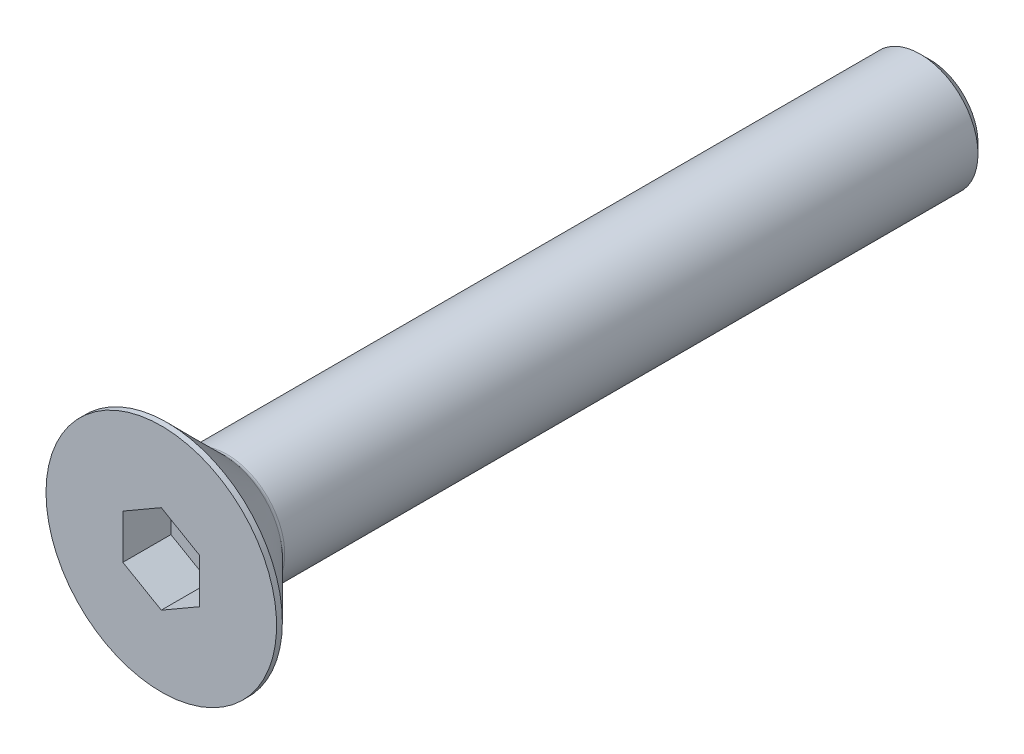
ISO-10303-21;
HEADER;
FILE_DESCRIPTION(('STEP AP214'),'2;1');
FILE_NAME('part.step','',(''),(''),'','','');
FILE_SCHEMA(('AUTOMOTIVE_DESIGN { 1 0 10303 214 1 1 1 1 }'));
ENDSEC;
DATA;
#1=APPLICATION_CONTEXT('core data for automotive mechanical design processes');
#2=APPLICATION_PROTOCOL_DEFINITION('international standard','automotive_design',2000,#1);
#3=PRODUCT_CONTEXT('',#1,'mechanical');
#4=PRODUCT('Part','Part','',(#3));
#5=PRODUCT_RELATED_PRODUCT_CATEGORY('part','',(#4));
#6=PRODUCT_DEFINITION_FORMATION('','',#4);
#7=PRODUCT_DEFINITION_CONTEXT('part definition',#1,'design');
#8=PRODUCT_DEFINITION('design','',#6,#7);
#9=PRODUCT_DEFINITION_SHAPE('','',#8);
#10=(LENGTH_UNIT() NAMED_UNIT(*) SI_UNIT(.MILLI.,.METRE.));
#11=(NAMED_UNIT(*) PLANE_ANGLE_UNIT() SI_UNIT($,.RADIAN.));
#12=(NAMED_UNIT(*) SI_UNIT($,.STERADIAN.) SOLID_ANGLE_UNIT());
#13=UNCERTAINTY_MEASURE_WITH_UNIT(LENGTH_MEASURE(1.E-05),#10,'distance_accuracy_value','');
#14=(GEOMETRIC_REPRESENTATION_CONTEXT(3) GLOBAL_UNCERTAINTY_ASSIGNED_CONTEXT((#13)) GLOBAL_UNIT_ASSIGNED_CONTEXT((#10,
#11,#12)) REPRESENTATION_CONTEXT('',''));
#15=CARTESIAN_POINT('',(0.,0.,0.));
#16=DIRECTION('',(0.,0.,1.));
#17=DIRECTION('',(1.,0.,0.));
#18=AXIS2_PLACEMENT_3D('',#15,#16,#17);
#19=CARTESIAN_POINT('',(0.,0.,-2.5));
#20=DIRECTION('',(0.,0.,1.));
#21=DIRECTION('',(1.,0.,0.));
#22=AXIS2_PLACEMENT_3D('',#19,#20,#21);
#23=PLANE('',#22);
#24=DIRECTION('',(-0.866025403784439,-0.5,0.));
#25=VECTOR('',#24,1.);
#26=CARTESIAN_POINT('',(0.,2.3094010767585,-2.5));
#27=LINE('',#26,#25);
#28=CARTESIAN_POINT('',(0.,2.3094010767585,-2.5));
#29=VERTEX_POINT('',#28);
#30=CARTESIAN_POINT('',(-2.,1.15470053837925,-2.5));
#31=VERTEX_POINT('',#30);
#32=EDGE_CURVE('E82',#29,#31,#27,.T.);
#33=ORIENTED_EDGE('',*,*,#32,.T.);
#34=DIRECTION('',(0.,1.,0.));
#35=VECTOR('',#34,1.);
#36=CARTESIAN_POINT('',(-2.,1.15470053837925,-2.5));
#37=LINE('',#36,#35);
#38=CARTESIAN_POINT('',(-2.,-1.15470053837925,-2.5));
#39=VERTEX_POINT('',#38);
#40=EDGE_CURVE('E66',#31,#39,#37,.F.);
#41=ORIENTED_EDGE('',*,*,#40,.T.);
#42=DIRECTION('',(0.866025403784439,-0.499999999999999,0.));
#43=VECTOR('',#42,1.);
#44=CARTESIAN_POINT('',(-2.,-1.15470053837925,-2.5));
#45=LINE('',#44,#43);
#46=CARTESIAN_POINT('',(0.,-2.3094010767585,-2.5));
#47=VERTEX_POINT('',#46);
#48=EDGE_CURVE('E71',#39,#47,#45,.T.);
#49=ORIENTED_EDGE('',*,*,#48,.T.);
#50=DIRECTION('',(0.866025403784439,0.5,0.));
#51=VECTOR('',#50,1.);
#52=CARTESIAN_POINT('',(0.,-2.3094010767585,-2.5));
#53=LINE('',#52,#51);
#54=CARTESIAN_POINT('',(2.,-1.15470053837925,-2.5));
#55=VERTEX_POINT('',#54);
#56=EDGE_CURVE('E128',#47,#55,#53,.T.);
#57=ORIENTED_EDGE('',*,*,#56,.T.);
#58=DIRECTION('',(0.,1.,0.));
#59=VECTOR('',#58,1.);
#60=CARTESIAN_POINT('',(2.,-1.15470053837925,-2.5));
#61=LINE('',#60,#59);
#62=CARTESIAN_POINT('',(2.,1.15470053837925,-2.5));
#63=VERTEX_POINT('',#62);
#64=EDGE_CURVE('E132',#55,#63,#61,.T.);
#65=ORIENTED_EDGE('',*,*,#64,.T.);
#66=DIRECTION('',(-0.866025403784439,0.499999999999999,0.));
#67=VECTOR('',#66,1.);
#68=CARTESIAN_POINT('',(2.,1.15470053837925,-2.5));
#69=LINE('',#68,#67);
#70=EDGE_CURVE('E137',#63,#29,#69,.T.);
#71=ORIENTED_EDGE('',*,*,#70,.T.);
#72=EDGE_LOOP('',(#33,#41,#49,#57,#65,#71));
#73=FACE_BOUND('',#72,.T.);
#74=ADVANCED_FACE('F15',(#73),#23,.T.);
#75=CARTESIAN_POINT('',(-2.,-1.15470053837925,0.));
#76=DIRECTION('',(-0.499999999999999,-0.866025403784439,0.));
#77=DIRECTION('',(0.866025403784439,-0.499999999999999,0.));
#78=AXIS2_PLACEMENT_3D('',#75,#76,#77);
#79=PLANE('',#78);
#80=DIRECTION('',(0.,0.,1.));
#81=VECTOR('',#80,1.);
#82=CARTESIAN_POINT('',(-2.,-1.15470053837925,0.));
#83=LINE('',#82,#81);
#84=CARTESIAN_POINT('',(-2.,-1.15470053837925,0.));
#85=VERTEX_POINT('',#84);
#86=EDGE_CURVE('E73',#39,#85,#83,.T.);
#87=ORIENTED_EDGE('',*,*,#86,.T.);
#88=DIRECTION('',(-0.866025403784439,0.499999999999999,0.));
#89=VECTOR('',#88,1.);
#90=CARTESIAN_POINT('',(0.,-2.3094010767585,0.));
#91=LINE('',#90,#89);
#92=CARTESIAN_POINT('',(0.,-2.3094010767585,0.));
#93=VERTEX_POINT('',#92);
#94=EDGE_CURVE('E126',#93,#85,#91,.T.);
#95=ORIENTED_EDGE('',*,*,#94,.F.);
#96=DIRECTION('',(0.,0.,1.));
#97=VECTOR('',#96,1.);
#98=CARTESIAN_POINT('',(0.,-2.3094010767585,0.));
#99=LINE('',#98,#97);
#100=EDGE_CURVE('E76',#93,#47,#99,.F.);
#101=ORIENTED_EDGE('',*,*,#100,.T.);
#102=ORIENTED_EDGE('',*,*,#48,.F.);
#103=EDGE_LOOP('',(#87,#95,#101,#102));
#104=FACE_BOUND('',#103,.T.);
#105=ADVANCED_FACE('F72',(#104),#79,.F.);
#106=CARTESIAN_POINT('',(-2.,1.15470053837925,0.));
#107=DIRECTION('',(-1.,0.,0.));
#108=DIRECTION('',(0.,0.,1.));
#109=AXIS2_PLACEMENT_3D('',#106,#107,#108);
#110=PLANE('',#109);
#111=DIRECTION('',(0.,0.,1.));
#112=VECTOR('',#111,1.);
#113=CARTESIAN_POINT('',(-2.,1.15470053837925,0.));
#114=LINE('',#113,#112);
#115=CARTESIAN_POINT('',(-2.,1.15470053837925,0.));
#116=VERTEX_POINT('',#115);
#117=EDGE_CURVE('E84',#31,#116,#114,.T.);
#118=ORIENTED_EDGE('',*,*,#117,.T.);
#119=DIRECTION('',(0.,1.,0.));
#120=VECTOR('',#119,1.);
#121=CARTESIAN_POINT('',(-2.,0.,0.));
#122=LINE('',#121,#120);
#123=EDGE_CURVE('E88',#85,#116,#122,.T.);
#124=ORIENTED_EDGE('',*,*,#123,.F.);
#125=ORIENTED_EDGE('',*,*,#86,.F.);
#126=ORIENTED_EDGE('',*,*,#40,.F.);
#127=EDGE_LOOP('',(#118,#124,#125,#126));
#128=FACE_BOUND('',#127,.T.);
#129=ADVANCED_FACE('F86',(#128),#110,.F.);
#130=CARTESIAN_POINT('',(0.,2.3094010767585,0.));
#131=DIRECTION('',(-0.5,0.866025403784439,0.));
#132=DIRECTION('',(-0.866025403784439,-0.5,0.));
#133=AXIS2_PLACEMENT_3D('',#130,#131,#132);
#134=PLANE('',#133);
#135=DIRECTION('',(0.,0.,1.));
#136=VECTOR('',#135,1.);
#137=CARTESIAN_POINT('',(0.,2.3094010767585,0.));
#138=LINE('',#137,#136);
#139=CARTESIAN_POINT('',(0.,2.3094010767585,0.));
#140=VERTEX_POINT('',#139);
#141=EDGE_CURVE('E139',#29,#140,#138,.T.);
#142=ORIENTED_EDGE('',*,*,#141,.T.);
#143=DIRECTION('',(0.866025403784439,0.5,0.));
#144=VECTOR('',#143,1.);
#145=CARTESIAN_POINT('',(-2.,1.15470053837925,0.));
#146=LINE('',#145,#144);
#147=EDGE_CURVE('E122',#116,#140,#146,.T.);
#148=ORIENTED_EDGE('',*,*,#147,.F.);
#149=ORIENTED_EDGE('',*,*,#117,.F.);
#150=ORIENTED_EDGE('',*,*,#32,.F.);
#151=EDGE_LOOP('',(#142,#148,#149,#150));
#152=FACE_BOUND('',#151,.T.);
#153=ADVANCED_FACE('F143',(#152),#134,.F.);
#154=CARTESIAN_POINT('',(2.,1.15470053837925,0.));
#155=DIRECTION('',(0.499999999999999,0.866025403784439,0.));
#156=DIRECTION('',(-0.866025403784439,0.499999999999999,0.));
#157=AXIS2_PLACEMENT_3D('',#154,#155,#156);
#158=PLANE('',#157);
#159=DIRECTION('',(0.,0.,-1.));
#160=VECTOR('',#159,1.);
#161=CARTESIAN_POINT('',(2.,1.15470053837925,0.));
#162=LINE('',#161,#160);
#163=CARTESIAN_POINT('',(2.,1.15470053837925,0.));
#164=VERTEX_POINT('',#163);
#165=EDGE_CURVE('E135',#63,#164,#162,.F.);
#166=ORIENTED_EDGE('',*,*,#165,.T.);
#167=DIRECTION('',(0.866025403784439,-0.499999999999999,0.));
#168=VECTOR('',#167,1.);
#169=CARTESIAN_POINT('',(0.,2.3094010767585,0.));
#170=LINE('',#169,#168);
#171=EDGE_CURVE('E119',#140,#164,#170,.T.);
#172=ORIENTED_EDGE('',*,*,#171,.F.);
#173=ORIENTED_EDGE('',*,*,#141,.F.);
#174=ORIENTED_EDGE('',*,*,#70,.F.);
#175=EDGE_LOOP('',(#166,#172,#173,#174));
#176=FACE_BOUND('',#175,.T.);
#177=ADVANCED_FACE('F154',(#176),#158,.F.);
#178=CARTESIAN_POINT('',(2.,-1.15470053837925,0.));
#179=DIRECTION('',(1.,0.,0.));
#180=DIRECTION('',(0.,0.,-1.));
#181=AXIS2_PLACEMENT_3D('',#178,#179,#180);
#182=PLANE('',#181);
#183=DIRECTION('',(0.,0.,1.));
#184=VECTOR('',#183,1.);
#185=CARTESIAN_POINT('',(2.,-1.15470053837925,0.));
#186=LINE('',#185,#184);
#187=CARTESIAN_POINT('',(2.,-1.15470053837925,0.));
#188=VERTEX_POINT('',#187);
#189=EDGE_CURVE('E34',#55,#188,#186,.T.);
#190=ORIENTED_EDGE('',*,*,#189,.T.);
#191=DIRECTION('',(0.,1.,0.));
#192=VECTOR('',#191,1.);
#193=CARTESIAN_POINT('',(2.,0.,0.));
#194=LINE('',#193,#192);
#195=EDGE_CURVE('E116',#164,#188,#194,.F.);
#196=ORIENTED_EDGE('',*,*,#195,.F.);
#197=ORIENTED_EDGE('',*,*,#165,.F.);
#198=ORIENTED_EDGE('',*,*,#64,.F.);
#199=EDGE_LOOP('',(#190,#196,#197,#198));
#200=FACE_BOUND('',#199,.T.);
#201=ADVANCED_FACE('F152',(#200),#182,.F.);
#202=CARTESIAN_POINT('',(0.,-2.3094010767585,0.));
#203=DIRECTION('',(0.5,-0.866025403784439,0.));
#204=DIRECTION('',(0.866025403784439,0.5,0.));
#205=AXIS2_PLACEMENT_3D('',#202,#203,#204);
#206=PLANE('',#205);
#207=ORIENTED_EDGE('',*,*,#100,.F.);
#208=DIRECTION('',(-0.866025403784439,-0.5,0.));
#209=VECTOR('',#208,1.);
#210=CARTESIAN_POINT('',(2.,-1.15470053837925,0.));
#211=LINE('',#210,#209);
#212=EDGE_CURVE('E113',#188,#93,#211,.T.);
#213=ORIENTED_EDGE('',*,*,#212,.F.);
#214=ORIENTED_EDGE('',*,*,#189,.F.);
#215=ORIENTED_EDGE('',*,*,#56,.F.);
#216=EDGE_LOOP('',(#207,#213,#214,#215));
#217=FACE_BOUND('',#216,.T.);
#218=ADVANCED_FACE('F150',(#217),#206,.F.);
#219=CARTESIAN_POINT('',(3.,0.,0.));
#220=DIRECTION('',(0.,0.,1.));
#221=DIRECTION('',(1.,0.,0.));
#222=AXIS2_PLACEMENT_3D('',#219,#220,#221);
#223=PLANE('',#222);
#224=ORIENTED_EDGE('',*,*,#195,.T.);
#225=ORIENTED_EDGE('',*,*,#212,.T.);
#226=ORIENTED_EDGE('',*,*,#94,.T.);
#227=ORIENTED_EDGE('',*,*,#123,.T.);
#228=ORIENTED_EDGE('',*,*,#147,.T.);
#229=ORIENTED_EDGE('',*,*,#171,.T.);
#230=EDGE_LOOP('',(#224,#225,#226,#227,#228,#229));
#231=FACE_BOUND('',#230,.T.);
#232=CARTESIAN_POINT('',(0.,0.,0.));
#233=DIRECTION('',(0.,0.,-1.));
#234=DIRECTION('',(-1.,0.,0.));
#235=AXIS2_PLACEMENT_3D('',#232,#233,#234);
#236=CIRCLE('',#235,6.);
#237=CARTESIAN_POINT('',(-6.,0.,0.));
#238=VERTEX_POINT('',#237);
#239=EDGE_CURVE('E19',#238,#238,#236,.T.);
#240=ORIENTED_EDGE('',*,*,#239,.F.);
#241=EDGE_LOOP('',(#240));
#242=FACE_BOUND('',#241,.T.);
#243=ADVANCED_FACE('F147',(#231,#242),#223,.T.);
#244=CARTESIAN_POINT('',(0.,0.,-0.150000000000001));
#245=DIRECTION('',(0.,0.,-1.));
#246=DIRECTION('',(-1.,0.,0.));
#247=AXIS2_PLACEMENT_3D('',#244,#245,#246);
#248=CYLINDRICAL_SURFACE('',#247,6.);
#249=ORIENTED_EDGE('',*,*,#239,.T.);
#250=EDGE_LOOP('',(#249));
#251=FACE_BOUND('',#250,.T.);
#252=CARTESIAN_POINT('',(0.,0.,-0.299999998617295));
#253=DIRECTION('',(0.,0.,1.));
#254=DIRECTION('',(1.,0.,0.));
#255=AXIS2_PLACEMENT_3D('',#252,#253,#254);
#256=CIRCLE('',#255,5.99999999872125);
#257=CARTESIAN_POINT('',(5.99999999872125,0.,-0.299999998617295));
#258=VERTEX_POINT('',#257);
#259=EDGE_CURVE('E100',#258,#258,#256,.F.);
#260=ORIENTED_EDGE('',*,*,#259,.F.);
#261=EDGE_LOOP('',(#260));
#262=FACE_BOUND('',#261,.T.);
#263=ADVANCED_FACE('F183',(#251,#262),#248,.T.);
#264=CARTESIAN_POINT('',(0.,0.,-0.299999998617295));
#265=DIRECTION('',(0.,0.,1.));
#266=DIRECTION('',(1.,0.,0.));
#267=AXIS2_PLACEMENT_3D('',#264,#265,#266);
#268=CONICAL_SURFACE('',#267,5.99999999872125,0.78539816249955);
#269=CARTESIAN_POINT('',(0.,0.,-3.21213203435597));
#270=DIRECTION('',(0.,0.,-1.));
#271=DIRECTION('',(-1.,0.,0.));
#272=AXIS2_PLACEMENT_3D('',#269,#270,#271);
#273=CIRCLE('',#272,3.08786796564404);
#274=CARTESIAN_POINT('',(-3.08786796564404,0.,-3.21213203435597));
#275=VERTEX_POINT('',#274);
#276=EDGE_CURVE('E94',#275,#275,#273,.T.);
#277=ORIENTED_EDGE('',*,*,#276,.F.);
#278=EDGE_LOOP('',(#277));
#279=FACE_BOUND('',#278,.T.);
#280=ORIENTED_EDGE('',*,*,#259,.T.);
#281=EDGE_LOOP('',(#280));
#282=FACE_BOUND('',#281,.T.);
#283=ADVANCED_FACE('F179',(#279,#282),#268,.T.);
#284=CARTESIAN_POINT('',(1.5,0.,-40.));
#285=DIRECTION('',(0.,0.,-1.));
#286=DIRECTION('',(-1.,0.,0.));
#287=AXIS2_PLACEMENT_3D('',#284,#285,#286);
#288=PLANE('',#287);
#289=CARTESIAN_POINT('',(0.,0.,-40.0000000002478));
#290=DIRECTION('',(0.,0.,1.));
#291=DIRECTION('',(1.,0.,0.));
#292=AXIS2_PLACEMENT_3D('',#289,#290,#291);
#293=CIRCLE('',#292,2.5000000002251);
#294=CARTESIAN_POINT('',(2.5000000002251,0.,-40.0000000002478));
#295=VERTEX_POINT('',#294);
#296=EDGE_CURVE('E92',#295,#295,#293,.T.);
#297=ORIENTED_EDGE('',*,*,#296,.F.);
#298=EDGE_LOOP('',(#297));
#299=FACE_BOUND('',#298,.T.);
#300=ADVANCED_FACE('F176',(#299),#288,.T.);
#301=CARTESIAN_POINT('',(0.,0.,-3.42426406871193));
#302=DIRECTION('',(0.,0.,-1.));
#303=DIRECTION('',(-1.,0.,0.));
#304=AXIS2_PLACEMENT_3D('',#301,#302,#303);
#305=TOROIDAL_SURFACE('',#304,3.3,0.3);
#306=CARTESIAN_POINT('',(0.,0.,-3.42426406871193));
#307=DIRECTION('',(0.,0.,-1.));
#308=DIRECTION('',(-1.,0.,0.));
#309=AXIS2_PLACEMENT_3D('',#306,#307,#308);
#310=CIRCLE('',#309,3.);
#311=CARTESIAN_POINT('',(-3.,0.,-3.42426406871193));
#312=VERTEX_POINT('',#311);
#313=EDGE_CURVE('E25',#312,#312,#310,.T.);
#314=ORIENTED_EDGE('',*,*,#313,.F.);
#315=EDGE_LOOP('',(#314));
#316=FACE_BOUND('',#315,.T.);
#317=ORIENTED_EDGE('',*,*,#276,.T.);
#318=EDGE_LOOP('',(#317));
#319=FACE_BOUND('',#318,.T.);
#320=ADVANCED_FACE('F17',(#316,#319),#305,.F.);
#321=CARTESIAN_POINT('',(0.,0.,-39.4999999998049));
#322=DIRECTION('',(0.,0.,1.));
#323=DIRECTION('',(1.,0.,0.));
#324=AXIS2_PLACEMENT_3D('',#321,#322,#323);
#325=CONICAL_SURFACE('',#324,2.99999999975853,0.785398162487954);
#326=ORIENTED_EDGE('',*,*,#296,.T.);
#327=EDGE_LOOP('',(#326));
#328=FACE_BOUND('',#327,.T.);
#329=CARTESIAN_POINT('',(0.,0.,-39.5));
#330=DIRECTION('',(0.,0.,-1.));
#331=DIRECTION('',(-1.,0.,0.));
#332=AXIS2_PLACEMENT_3D('',#329,#330,#331);
#333=CIRCLE('',#332,3.);
#334=CARTESIAN_POINT('',(-3.,0.,-39.5));
#335=VERTEX_POINT('',#334);
#336=EDGE_CURVE('E10',#335,#335,#333,.F.);
#337=ORIENTED_EDGE('',*,*,#336,.F.);
#338=EDGE_LOOP('',(#337));
#339=FACE_BOUND('',#338,.T.);
#340=ADVANCED_FACE('F166',(#328,#339),#325,.T.);
#341=CARTESIAN_POINT('',(0.,0.,-21.65));
#342=DIRECTION('',(0.,0.,-1.));
#343=DIRECTION('',(-1.,0.,0.));
#344=AXIS2_PLACEMENT_3D('',#341,#342,#343);
#345=CYLINDRICAL_SURFACE('',#344,3.);
#346=ORIENTED_EDGE('',*,*,#336,.T.);
#347=EDGE_LOOP('',(#346));
#348=FACE_BOUND('',#347,.T.);
#349=ORIENTED_EDGE('',*,*,#313,.T.);
#350=EDGE_LOOP('',(#349));
#351=FACE_BOUND('',#350,.T.);
#352=ADVANCED_FACE('F164',(#348,#351),#345,.T.);
#353=CLOSED_SHELL('',(#74,#105,#129,#153,#177,#201,#218,#243,#263,#283,#300,#320,#340,#352));
#354=MANIFOLD_SOLID_BREP('B1',#353);
#355=ADVANCED_BREP_SHAPE_REPRESENTATION('',(#18,#354),#14);
#356=SHAPE_DEFINITION_REPRESENTATION(#9,#355);
ENDSEC;
END-ISO-10303-21;
